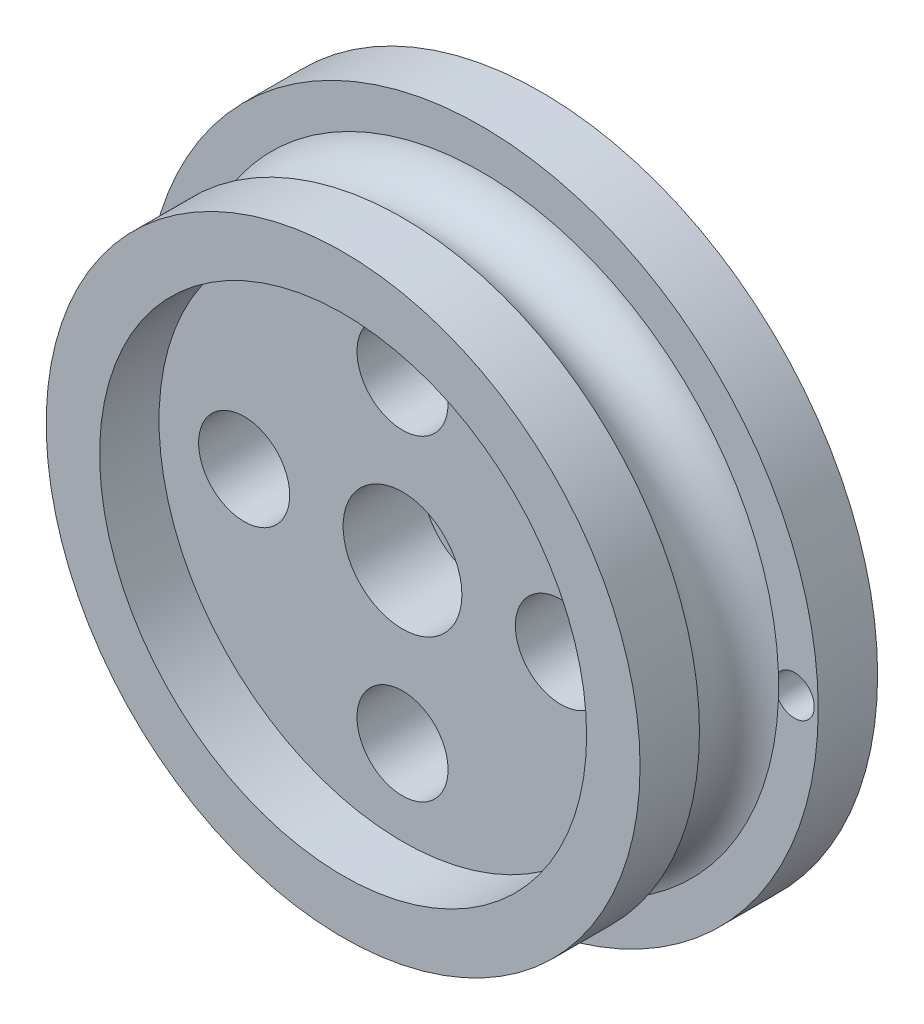
ISO-10303-21;
HEADER;
FILE_DESCRIPTION(('STEP AP214'),'2;1');
FILE_NAME('part.step','',(''),(''),'','','');
FILE_SCHEMA(('AUTOMOTIVE_DESIGN { 1 0 10303 214 1 1 1 1 }'));
ENDSEC;
DATA;
#1=APPLICATION_CONTEXT('core data for automotive mechanical design processes');
#2=APPLICATION_PROTOCOL_DEFINITION('international standard','automotive_design',2000,#1);
#3=PRODUCT_CONTEXT('',#1,'mechanical');
#4=PRODUCT('Part','Part','',(#3));
#5=PRODUCT_RELATED_PRODUCT_CATEGORY('part','',(#4));
#6=PRODUCT_DEFINITION_FORMATION('','',#4);
#7=PRODUCT_DEFINITION_CONTEXT('part definition',#1,'design');
#8=PRODUCT_DEFINITION('design','',#6,#7);
#9=PRODUCT_DEFINITION_SHAPE('','',#8);
#10=(LENGTH_UNIT() NAMED_UNIT(*) SI_UNIT(.MILLI.,.METRE.));
#11=(NAMED_UNIT(*) PLANE_ANGLE_UNIT() SI_UNIT($,.RADIAN.));
#12=(NAMED_UNIT(*) SI_UNIT($,.STERADIAN.) SOLID_ANGLE_UNIT());
#13=UNCERTAINTY_MEASURE_WITH_UNIT(LENGTH_MEASURE(1.E-05),#10,'distance_accuracy_value','');
#14=(GEOMETRIC_REPRESENTATION_CONTEXT(3) GLOBAL_UNCERTAINTY_ASSIGNED_CONTEXT((#13)) GLOBAL_UNIT_ASSIGNED_CONTEXT((#10,
#11,#12)) REPRESENTATION_CONTEXT('',''));
#15=CARTESIAN_POINT('',(0.,0.,0.));
#16=DIRECTION('',(0.,0.,1.));
#17=DIRECTION('',(1.,0.,0.));
#18=AXIS2_PLACEMENT_3D('',#15,#16,#17);
#19=CARTESIAN_POINT('',(0.,0.,4.));
#20=DIRECTION('',(0.,0.,1.));
#21=DIRECTION('',(1.,0.,0.));
#22=AXIS2_PLACEMENT_3D('',#19,#20,#21);
#23=PLANE('',#22);
#24=CARTESIAN_POINT('',(0.,-8.,4.));
#25=DIRECTION('',(0.,0.,1.));
#26=DIRECTION('',(1.,0.,0.));
#27=AXIS2_PLACEMENT_3D('',#24,#25,#26);
#28=CIRCLE('',#27,2.3);
#29=CARTESIAN_POINT('',(2.3,-8.,4.));
#30=VERTEX_POINT('',#29);
#31=EDGE_CURVE('E101',#30,#30,#28,.T.);
#32=ORIENTED_EDGE('',*,*,#31,.F.);
#33=EDGE_LOOP('',(#32));
#34=FACE_BOUND('',#33,.T.);
#35=CARTESIAN_POINT('',(0.,8.,4.));
#36=DIRECTION('',(0.,0.,1.));
#37=DIRECTION('',(1.,0.,0.));
#38=AXIS2_PLACEMENT_3D('',#35,#36,#37);
#39=CIRCLE('',#38,2.3);
#40=CARTESIAN_POINT('',(2.3,8.,4.));
#41=VERTEX_POINT('',#40);
#42=EDGE_CURVE('E113',#41,#41,#39,.T.);
#43=ORIENTED_EDGE('',*,*,#42,.F.);
#44=EDGE_LOOP('',(#43));
#45=FACE_BOUND('',#44,.T.);
#46=CARTESIAN_POINT('',(0.,0.,4.));
#47=DIRECTION('',(0.,0.,1.));
#48=DIRECTION('',(1.,0.,0.));
#49=AXIS2_PLACEMENT_3D('',#46,#47,#48);
#50=CIRCLE('',#49,3.);
#51=CARTESIAN_POINT('',(3.,0.,4.));
#52=VERTEX_POINT('',#51);
#53=EDGE_CURVE('E125',#52,#52,#50,.T.);
#54=ORIENTED_EDGE('',*,*,#53,.F.);
#55=EDGE_LOOP('',(#54));
#56=FACE_BOUND('',#55,.T.);
#57=CARTESIAN_POINT('',(-8.,0.,4.));
#58=DIRECTION('',(0.,0.,1.));
#59=DIRECTION('',(1.,0.,0.));
#60=AXIS2_PLACEMENT_3D('',#57,#58,#59);
#61=CIRCLE('',#60,2.3);
#62=CARTESIAN_POINT('',(-5.7,0.,4.));
#63=VERTEX_POINT('',#62);
#64=EDGE_CURVE('E119',#63,#63,#61,.T.);
#65=ORIENTED_EDGE('',*,*,#64,.F.);
#66=EDGE_LOOP('',(#65));
#67=FACE_BOUND('',#66,.T.);
#68=CARTESIAN_POINT('',(8.,0.,4.));
#69=DIRECTION('',(0.,0.,1.));
#70=DIRECTION('',(1.,0.,0.));
#71=AXIS2_PLACEMENT_3D('',#68,#69,#70);
#72=CIRCLE('',#71,2.3);
#73=CARTESIAN_POINT('',(10.3,0.,4.));
#74=VERTEX_POINT('',#73);
#75=EDGE_CURVE('E107',#74,#74,#72,.T.);
#76=ORIENTED_EDGE('',*,*,#75,.F.);
#77=EDGE_LOOP('',(#76));
#78=FACE_BOUND('',#77,.T.);
#79=CARTESIAN_POINT('',(0.,0.,4.));
#80=DIRECTION('',(0.,0.,1.));
#81=DIRECTION('',(1.,0.,0.));
#82=AXIS2_PLACEMENT_3D('',#79,#80,#81);
#83=CIRCLE('',#82,12.3);
#84=CARTESIAN_POINT('',(12.3,0.,4.));
#85=VERTEX_POINT('',#84);
#86=EDGE_CURVE('E11',#85,#85,#83,.F.);
#87=ORIENTED_EDGE('',*,*,#86,.F.);
#88=EDGE_LOOP('',(#87));
#89=FACE_BOUND('',#88,.T.);
#90=ADVANCED_FACE('F34',(#34,#45,#56,#67,#78,#89),#23,.T.);
#91=CARTESIAN_POINT('',(0.,0.,0.));
#92=DIRECTION('',(0.,0.,1.));
#93=DIRECTION('',(1.,0.,0.));
#94=AXIS2_PLACEMENT_3D('',#91,#92,#93);
#95=PLANE('',#94);
#96=CARTESIAN_POINT('',(15.8,0.,0.));
#97=DIRECTION('',(0.,0.,1.));
#98=DIRECTION('',(-1.,0.,0.));
#99=AXIS2_PLACEMENT_3D('',#96,#97,#98);
#100=CIRCLE('',#99,0.999999999999998);
#101=CARTESIAN_POINT('',(14.9886075949367,0.584501809240675,0.));
#102=VERTEX_POINT('',#101);
#103=CARTESIAN_POINT('',(14.9886075949367,-0.584501809240644,0.));
#104=VERTEX_POINT('',#103);
#105=EDGE_CURVE('E42',#102,#104,#100,.T.);
#106=ORIENTED_EDGE('',*,*,#105,.F.);
#107=CARTESIAN_POINT('',(0.,0.,0.));
#108=DIRECTION('',(0.,0.,1.));
#109=DIRECTION('',(1.,0.,0.));
#110=AXIS2_PLACEMENT_3D('',#107,#108,#109);
#111=CIRCLE('',#110,15.);
#112=EDGE_CURVE('E63',#104,#102,#111,.T.);
#113=ORIENTED_EDGE('',*,*,#112,.F.);
#114=EDGE_LOOP('',(#106,#113));
#115=FACE_BOUND('',#114,.T.);
#116=ADVANCED_FACE('F36',(#115),#95,.F.);
#117=CARTESIAN_POINT('',(-15.8,0.,0.));
#118=DIRECTION('',(0.,0.,1.));
#119=DIRECTION('',(1.,0.,0.));
#120=AXIS2_PLACEMENT_3D('',#117,#118,#119);
#121=CIRCLE('',#120,0.999999999999998);
#122=CARTESIAN_POINT('',(-14.9886075949367,-0.584501809240671,0.));
#123=VERTEX_POINT('',#122);
#124=CARTESIAN_POINT('',(-14.9886075949367,0.584501809240666,0.));
#125=VERTEX_POINT('',#124);
#126=EDGE_CURVE('E69',#123,#125,#121,.T.);
#127=ORIENTED_EDGE('',*,*,#126,.F.);
#128=EDGE_CURVE('E49',#125,#123,#111,.T.);
#129=ORIENTED_EDGE('',*,*,#128,.F.);
#130=EDGE_LOOP('',(#127,#129));
#131=FACE_BOUND('',#130,.T.);
#132=ADVANCED_FACE('F72',(#131),#95,.F.);
#133=CARTESIAN_POINT('',(0.,0.,4.));
#134=DIRECTION('',(0.,0.,-1.));
#135=DIRECTION('',(-1.,0.,0.));
#136=AXIS2_PLACEMENT_3D('',#133,#134,#135);
#137=CYLINDRICAL_SURFACE('',#136,3.);
#138=ORIENTED_EDGE('',*,*,#53,.T.);
#139=EDGE_LOOP('',(#138));
#140=FACE_BOUND('',#139,.T.);
#141=CARTESIAN_POINT('',(0.,0.,0.));
#142=DIRECTION('',(0.,0.,1.));
#143=DIRECTION('',(1.,0.,0.));
#144=AXIS2_PLACEMENT_3D('',#141,#142,#143);
#145=CIRCLE('',#144,3.);
#146=CARTESIAN_POINT('',(3.,0.,0.));
#147=VERTEX_POINT('',#146);
#148=EDGE_CURVE('E122',#147,#147,#145,.T.);
#149=ORIENTED_EDGE('',*,*,#148,.F.);
#150=EDGE_LOOP('',(#149));
#151=FACE_BOUND('',#150,.T.);
#152=ADVANCED_FACE('F134',(#140,#151),#137,.F.);
#153=CARTESIAN_POINT('',(-8.,0.,4.));
#154=DIRECTION('',(0.,0.,-1.));
#155=DIRECTION('',(-1.,0.,0.));
#156=AXIS2_PLACEMENT_3D('',#153,#154,#155);
#157=CYLINDRICAL_SURFACE('',#156,2.3);
#158=ORIENTED_EDGE('',*,*,#64,.T.);
#159=EDGE_LOOP('',(#158));
#160=FACE_BOUND('',#159,.T.);
#161=CARTESIAN_POINT('',(-8.,0.,0.));
#162=DIRECTION('',(0.,0.,1.));
#163=DIRECTION('',(1.,0.,0.));
#164=AXIS2_PLACEMENT_3D('',#161,#162,#163);
#165=CIRCLE('',#164,2.3);
#166=CARTESIAN_POINT('',(-5.7,0.,0.));
#167=VERTEX_POINT('',#166);
#168=EDGE_CURVE('E116',#167,#167,#165,.T.);
#169=ORIENTED_EDGE('',*,*,#168,.F.);
#170=EDGE_LOOP('',(#169));
#171=FACE_BOUND('',#170,.T.);
#172=ADVANCED_FACE('F136',(#160,#171),#157,.F.);
#173=CARTESIAN_POINT('',(0.,8.,4.));
#174=DIRECTION('',(0.,0.,-1.));
#175=DIRECTION('',(-1.,0.,0.));
#176=AXIS2_PLACEMENT_3D('',#173,#174,#175);
#177=CYLINDRICAL_SURFACE('',#176,2.3);
#178=ORIENTED_EDGE('',*,*,#42,.T.);
#179=EDGE_LOOP('',(#178));
#180=FACE_BOUND('',#179,.T.);
#181=CARTESIAN_POINT('',(0.,8.,0.));
#182=DIRECTION('',(0.,0.,1.));
#183=DIRECTION('',(1.,0.,0.));
#184=AXIS2_PLACEMENT_3D('',#181,#182,#183);
#185=CIRCLE('',#184,2.3);
#186=CARTESIAN_POINT('',(2.3,8.,0.));
#187=VERTEX_POINT('',#186);
#188=EDGE_CURVE('E110',#187,#187,#185,.T.);
#189=ORIENTED_EDGE('',*,*,#188,.F.);
#190=EDGE_LOOP('',(#189));
#191=FACE_BOUND('',#190,.T.);
#192=ADVANCED_FACE('F143',(#180,#191),#177,.F.);
#193=CARTESIAN_POINT('',(8.,0.,4.));
#194=DIRECTION('',(0.,0.,-1.));
#195=DIRECTION('',(-1.,0.,0.));
#196=AXIS2_PLACEMENT_3D('',#193,#194,#195);
#197=CYLINDRICAL_SURFACE('',#196,2.3);
#198=ORIENTED_EDGE('',*,*,#75,.T.);
#199=EDGE_LOOP('',(#198));
#200=FACE_BOUND('',#199,.T.);
#201=CARTESIAN_POINT('',(8.,0.,0.));
#202=DIRECTION('',(0.,0.,1.));
#203=DIRECTION('',(1.,0.,0.));
#204=AXIS2_PLACEMENT_3D('',#201,#202,#203);
#205=CIRCLE('',#204,2.3);
#206=CARTESIAN_POINT('',(10.3,0.,0.));
#207=VERTEX_POINT('',#206);
#208=EDGE_CURVE('E104',#207,#207,#205,.T.);
#209=ORIENTED_EDGE('',*,*,#208,.F.);
#210=EDGE_LOOP('',(#209));
#211=FACE_BOUND('',#210,.T.);
#212=ADVANCED_FACE('F210',(#200,#211),#197,.F.);
#213=CARTESIAN_POINT('',(0.,-8.,4.));
#214=DIRECTION('',(0.,0.,-1.));
#215=DIRECTION('',(-1.,0.,0.));
#216=AXIS2_PLACEMENT_3D('',#213,#214,#215);
#217=CYLINDRICAL_SURFACE('',#216,2.3);
#218=ORIENTED_EDGE('',*,*,#31,.T.);
#219=EDGE_LOOP('',(#218));
#220=FACE_BOUND('',#219,.T.);
#221=CARTESIAN_POINT('',(0.,-8.,0.));
#222=DIRECTION('',(0.,0.,1.));
#223=DIRECTION('',(1.,0.,0.));
#224=AXIS2_PLACEMENT_3D('',#221,#222,#223);
#225=CIRCLE('',#224,2.3);
#226=CARTESIAN_POINT('',(2.3,-8.,0.));
#227=VERTEX_POINT('',#226);
#228=EDGE_CURVE('E98',#227,#227,#225,.T.);
#229=ORIENTED_EDGE('',*,*,#228,.F.);
#230=EDGE_LOOP('',(#229));
#231=FACE_BOUND('',#230,.T.);
#232=ADVANCED_FACE('F186',(#220,#231),#217,.F.);
#233=CARTESIAN_POINT('',(15.8,0.,-3.));
#234=DIRECTION('',(0.,0.,1.));
#235=DIRECTION('',(1.,0.,0.));
#236=AXIS2_PLACEMENT_3D('',#233,#234,#235);
#237=CYLINDRICAL_SURFACE('',#236,0.999999999999998);
#238=CARTESIAN_POINT('',(15.8,0.,-3.));
#239=DIRECTION('',(0.,0.,1.));
#240=DIRECTION('',(-1.,0.,0.));
#241=AXIS2_PLACEMENT_3D('',#238,#239,#240);
#242=CIRCLE('',#241,0.999999999999998);
#243=CARTESIAN_POINT('',(14.8,0.,-3.));
#244=VERTEX_POINT('',#243);
#245=EDGE_CURVE('E80',#244,#244,#242,.T.);
#246=ORIENTED_EDGE('',*,*,#245,.F.);
#247=EDGE_LOOP('',(#246));
#248=FACE_BOUND('',#247,.T.);
#249=EDGE_CURVE('E85',#104,#102,#100,.T.);
#250=ORIENTED_EDGE('',*,*,#249,.T.);
#251=ORIENTED_EDGE('',*,*,#105,.T.);
#252=EDGE_LOOP('',(#250,#251));
#253=FACE_BOUND('',#252,.T.);
#254=ADVANCED_FACE('F183',(#248,#253),#237,.F.);
#255=CARTESIAN_POINT('',(-15.8,0.,-3.));
#256=DIRECTION('',(0.,0.,1.));
#257=DIRECTION('',(1.,0.,0.));
#258=AXIS2_PLACEMENT_3D('',#255,#256,#257);
#259=CYLINDRICAL_SURFACE('',#258,0.999999999999998);
#260=CARTESIAN_POINT('',(-15.8,0.,-3.));
#261=DIRECTION('',(0.,0.,1.));
#262=DIRECTION('',(1.,0.,0.));
#263=AXIS2_PLACEMENT_3D('',#260,#261,#262);
#264=CIRCLE('',#263,0.999999999999998);
#265=CARTESIAN_POINT('',(-14.8,0.,-3.));
#266=VERTEX_POINT('',#265);
#267=EDGE_CURVE('E79',#266,#266,#264,.T.);
#268=ORIENTED_EDGE('',*,*,#267,.F.);
#269=EDGE_LOOP('',(#268));
#270=FACE_BOUND('',#269,.T.);
#271=EDGE_CURVE('E76',#125,#123,#121,.T.);
#272=ORIENTED_EDGE('',*,*,#271,.T.);
#273=ORIENTED_EDGE('',*,*,#126,.T.);
#274=EDGE_LOOP('',(#272,#273));
#275=FACE_BOUND('',#274,.T.);
#276=ADVANCED_FACE('F75',(#270,#275),#259,.F.);
#277=CARTESIAN_POINT('',(0.,0.,-3.));
#278=DIRECTION('',(0.,0.,1.));
#279=DIRECTION('',(1.,0.,0.));
#280=AXIS2_PLACEMENT_3D('',#277,#278,#279);
#281=CYLINDRICAL_SURFACE('',#280,1.475);
#282=CARTESIAN_POINT('',(0.,0.,-3.));
#283=DIRECTION('',(0.,0.,1.));
#284=DIRECTION('',(1.,0.,0.));
#285=AXIS2_PLACEMENT_3D('',#282,#283,#284);
#286=CIRCLE('',#285,1.475);
#287=CARTESIAN_POINT('',(1.475,0.,-3.));
#288=VERTEX_POINT('',#287);
#289=EDGE_CURVE('E89',#288,#288,#286,.T.);
#290=ORIENTED_EDGE('',*,*,#289,.F.);
#291=EDGE_LOOP('',(#290));
#292=FACE_BOUND('',#291,.T.);
#293=CARTESIAN_POINT('',(0.,0.,0.));
#294=DIRECTION('',(0.,0.,1.));
#295=DIRECTION('',(1.,0.,0.));
#296=AXIS2_PLACEMENT_3D('',#293,#294,#295);
#297=CIRCLE('',#296,1.475);
#298=CARTESIAN_POINT('',(1.475,0.,0.));
#299=VERTEX_POINT('',#298);
#300=EDGE_CURVE('E82',#299,#299,#297,.T.);
#301=ORIENTED_EDGE('',*,*,#300,.T.);
#302=EDGE_LOOP('',(#301));
#303=FACE_BOUND('',#302,.T.);
#304=ADVANCED_FACE('F190',(#292,#303),#281,.F.);
#305=CARTESIAN_POINT('',(0.,0.,-3.));
#306=DIRECTION('',(0.,0.,1.));
#307=DIRECTION('',(1.,0.,0.));
#308=AXIS2_PLACEMENT_3D('',#305,#306,#307);
#309=PLANE('',#308);
#310=ORIENTED_EDGE('',*,*,#245,.T.);
#311=EDGE_LOOP('',(#310));
#312=FACE_BOUND('',#311,.T.);
#313=ORIENTED_EDGE('',*,*,#267,.T.);
#314=EDGE_LOOP('',(#313));
#315=FACE_BOUND('',#314,.T.);
#316=ORIENTED_EDGE('',*,*,#289,.T.);
#317=EDGE_LOOP('',(#316));
#318=FACE_BOUND('',#317,.T.);
#319=CARTESIAN_POINT('',(0.,0.,-3.));
#320=DIRECTION('',(0.,0.,1.));
#321=DIRECTION('',(1.,0.,0.));
#322=AXIS2_PLACEMENT_3D('',#319,#320,#321);
#323=CIRCLE('',#322,17.);
#324=CARTESIAN_POINT('',(17.,0.,-3.));
#325=VERTEX_POINT('',#324);
#326=EDGE_CURVE('E95',#325,#325,#323,.T.);
#327=ORIENTED_EDGE('',*,*,#326,.F.);
#328=EDGE_LOOP('',(#327));
#329=FACE_BOUND('',#328,.T.);
#330=ADVANCED_FACE('F194',(#312,#315,#318,#329),#309,.F.);
#331=CARTESIAN_POINT('',(0.,0.,-3.));
#332=DIRECTION('',(0.,0.,1.));
#333=DIRECTION('',(1.,0.,0.));
#334=AXIS2_PLACEMENT_3D('',#331,#332,#333);
#335=CYLINDRICAL_SURFACE('',#334,17.);
#336=ORIENTED_EDGE('',*,*,#326,.T.);
#337=EDGE_LOOP('',(#336));
#338=FACE_BOUND('',#337,.T.);
#339=CARTESIAN_POINT('',(0.,0.,0.));
#340=DIRECTION('',(0.,0.,1.));
#341=DIRECTION('',(1.,0.,0.));
#342=AXIS2_PLACEMENT_3D('',#339,#340,#341);
#343=CIRCLE('',#342,17.);
#344=CARTESIAN_POINT('',(17.,0.,0.));
#345=VERTEX_POINT('',#344);
#346=EDGE_CURVE('E92',#345,#345,#343,.T.);
#347=ORIENTED_EDGE('',*,*,#346,.F.);
#348=EDGE_LOOP('',(#347));
#349=FACE_BOUND('',#348,.T.);
#350=ADVANCED_FACE('F198',(#338,#349),#335,.T.);
#351=CARTESIAN_POINT('',(0.,0.,0.));
#352=DIRECTION('',(0.,0.,1.));
#353=DIRECTION('',(1.,0.,0.));
#354=AXIS2_PLACEMENT_3D('',#351,#352,#353);
#355=PLANE('',#354);
#356=ORIENTED_EDGE('',*,*,#148,.T.);
#357=EDGE_LOOP('',(#356));
#358=FACE_BOUND('',#357,.T.);
#359=ORIENTED_EDGE('',*,*,#300,.F.);
#360=EDGE_LOOP('',(#359));
#361=FACE_BOUND('',#360,.T.);
#362=ADVANCED_FACE('F131',(#358,#361),#355,.T.);
#363=ORIENTED_EDGE('',*,*,#346,.T.);
#364=EDGE_LOOP('',(#363));
#365=FACE_BOUND('',#364,.T.);
#366=EDGE_CURVE('E60',#102,#125,#111,.T.);
#367=ORIENTED_EDGE('',*,*,#366,.F.);
#368=ORIENTED_EDGE('',*,*,#249,.F.);
#369=EDGE_CURVE('E54',#123,#104,#111,.T.);
#370=ORIENTED_EDGE('',*,*,#369,.F.);
#371=ORIENTED_EDGE('',*,*,#271,.F.);
#372=EDGE_LOOP('',(#367,#368,#370,#371));
#373=FACE_BOUND('',#372,.T.);
#374=ADVANCED_FACE('F78',(#365,#373),#355,.T.);
#375=ORIENTED_EDGE('',*,*,#228,.T.);
#376=EDGE_LOOP('',(#375));
#377=FACE_BOUND('',#376,.T.);
#378=ADVANCED_FACE('F200',(#377),#355,.T.);
#379=ORIENTED_EDGE('',*,*,#208,.T.);
#380=EDGE_LOOP('',(#379));
#381=FACE_BOUND('',#380,.T.);
#382=ADVANCED_FACE('F203',(#381),#355,.T.);
#383=ORIENTED_EDGE('',*,*,#188,.T.);
#384=EDGE_LOOP('',(#383));
#385=FACE_BOUND('',#384,.T.);
#386=ADVANCED_FACE('F222',(#385),#355,.T.);
#387=ORIENTED_EDGE('',*,*,#168,.T.);
#388=EDGE_LOOP('',(#387));
#389=FACE_BOUND('',#388,.T.);
#390=ADVANCED_FACE('F182',(#389),#355,.T.);
#391=CARTESIAN_POINT('',(0.,0.,2.));
#392=DIRECTION('',(0.,0.,-1.));
#393=DIRECTION('',(-1.,0.,0.));
#394=AXIS2_PLACEMENT_3D('',#391,#392,#393);
#395=TOROIDAL_SURFACE('',#394,15.5905965004093,2.08537867695431);
#396=ORIENTED_EDGE('',*,*,#366,.T.);
#397=ORIENTED_EDGE('',*,*,#128,.T.);
#398=ORIENTED_EDGE('',*,*,#369,.T.);
#399=ORIENTED_EDGE('',*,*,#112,.T.);
#400=EDGE_LOOP('',(#396,#397,#398,#399));
#401=FACE_BOUND('',#400,.T.);
#402=CARTESIAN_POINT('',(0.,0.,4.));
#403=DIRECTION('',(0.,0.,1.));
#404=DIRECTION('',(1.,0.,0.));
#405=AXIS2_PLACEMENT_3D('',#402,#403,#404);
#406=CIRCLE('',#405,15.);
#407=CARTESIAN_POINT('',(15.,0.,4.));
#408=VERTEX_POINT('',#407);
#409=EDGE_CURVE('E382',#408,#408,#406,.T.);
#410=ORIENTED_EDGE('',*,*,#409,.F.);
#411=EDGE_LOOP('',(#410));
#412=FACE_BOUND('',#411,.T.);
#413=ADVANCED_FACE('F61',(#401,#412),#395,.F.);
#414=CARTESIAN_POINT('',(0.,0.,7.));
#415=DIRECTION('',(0.,0.,1.));
#416=DIRECTION('',(1.,0.,0.));
#417=AXIS2_PLACEMENT_3D('',#414,#415,#416);
#418=PLANE('',#417);
#419=CARTESIAN_POINT('',(0.,0.,7.));
#420=DIRECTION('',(0.,0.,1.));
#421=DIRECTION('',(1.,0.,0.));
#422=AXIS2_PLACEMENT_3D('',#419,#420,#421);
#423=CIRCLE('',#422,15.);
#424=CARTESIAN_POINT('',(15.,0.,7.));
#425=VERTEX_POINT('',#424);
#426=EDGE_CURVE('E380',#425,#425,#423,.T.);
#427=ORIENTED_EDGE('',*,*,#426,.T.);
#428=EDGE_LOOP('',(#427));
#429=FACE_BOUND('',#428,.T.);
#430=CARTESIAN_POINT('',(0.,0.,7.));
#431=DIRECTION('',(0.,0.,1.));
#432=DIRECTION('',(1.,0.,0.));
#433=AXIS2_PLACEMENT_3D('',#430,#431,#432);
#434=CIRCLE('',#433,12.3);
#435=CARTESIAN_POINT('',(12.3,0.,7.));
#436=VERTEX_POINT('',#435);
#437=EDGE_CURVE('E386',#436,#436,#434,.T.);
#438=ORIENTED_EDGE('',*,*,#437,.F.);
#439=EDGE_LOOP('',(#438));
#440=FACE_BOUND('',#439,.T.);
#441=ADVANCED_FACE('F172',(#429,#440),#418,.T.);
#442=CARTESIAN_POINT('',(0.,0.,7.));
#443=DIRECTION('',(0.,0.,-1.));
#444=DIRECTION('',(-1.,0.,0.));
#445=AXIS2_PLACEMENT_3D('',#442,#443,#444);
#446=CYLINDRICAL_SURFACE('',#445,15.);
#447=ORIENTED_EDGE('',*,*,#426,.F.);
#448=EDGE_LOOP('',(#447));
#449=FACE_BOUND('',#448,.T.);
#450=ORIENTED_EDGE('',*,*,#409,.T.);
#451=EDGE_LOOP('',(#450));
#452=FACE_BOUND('',#451,.T.);
#453=ADVANCED_FACE('F166',(#449,#452),#446,.T.);
#454=CARTESIAN_POINT('',(0.,0.,7.));
#455=DIRECTION('',(0.,0.,-1.));
#456=DIRECTION('',(-1.,0.,0.));
#457=AXIS2_PLACEMENT_3D('',#454,#455,#456);
#458=CYLINDRICAL_SURFACE('',#457,12.3);
#459=ORIENTED_EDGE('',*,*,#437,.T.);
#460=EDGE_LOOP('',(#459));
#461=FACE_BOUND('',#460,.T.);
#462=ORIENTED_EDGE('',*,*,#86,.T.);
#463=EDGE_LOOP('',(#462));
#464=FACE_BOUND('',#463,.T.);
#465=ADVANCED_FACE('F164',(#461,#464),#458,.F.);
#466=CLOSED_SHELL('',(#90,#116,#132,#152,#172,#192,#212,#232,#254,#276,#304,#330,#350,#362,#374,
#378,#382,#386,#390,#413,#441,#453,#465));
#467=MANIFOLD_SOLID_BREP('B2',#466);
#468=ADVANCED_BREP_SHAPE_REPRESENTATION('',(#18,#467),#14);
#469=SHAPE_DEFINITION_REPRESENTATION(#9,#468);
ENDSEC;
END-ISO-10303-21;
